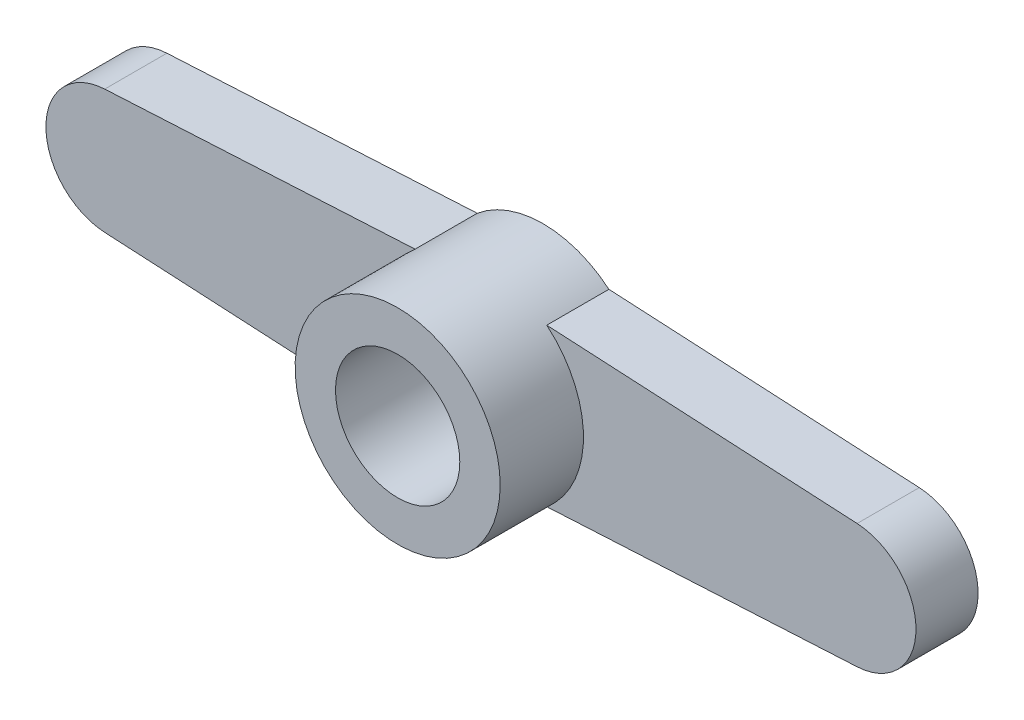
ISO-10303-21;
HEADER;
FILE_DESCRIPTION(('STEP AP214'),'2;1');
FILE_NAME('part.step','',(''),(''),'','','');
FILE_SCHEMA(('AUTOMOTIVE_DESIGN { 1 0 10303 214 1 1 1 1 }'));
ENDSEC;
DATA;
#1=APPLICATION_CONTEXT('core data for automotive mechanical design processes');
#2=APPLICATION_PROTOCOL_DEFINITION('international standard','automotive_design',2000,#1);
#3=PRODUCT_CONTEXT('',#1,'mechanical');
#4=PRODUCT('Part','Part','',(#3));
#5=PRODUCT_RELATED_PRODUCT_CATEGORY('part','',(#4));
#6=PRODUCT_DEFINITION_FORMATION('','',#4);
#7=PRODUCT_DEFINITION_CONTEXT('part definition',#1,'design');
#8=PRODUCT_DEFINITION('design','',#6,#7);
#9=PRODUCT_DEFINITION_SHAPE('','',#8);
#10=(LENGTH_UNIT() NAMED_UNIT(*) SI_UNIT(.MILLI.,.METRE.));
#11=(NAMED_UNIT(*) PLANE_ANGLE_UNIT() SI_UNIT($,.RADIAN.));
#12=(NAMED_UNIT(*) SI_UNIT($,.STERADIAN.) SOLID_ANGLE_UNIT());
#13=UNCERTAINTY_MEASURE_WITH_UNIT(LENGTH_MEASURE(1.E-05),#10,'distance_accuracy_value','');
#14=(GEOMETRIC_REPRESENTATION_CONTEXT(3) GLOBAL_UNCERTAINTY_ASSIGNED_CONTEXT((#13)) GLOBAL_UNIT_ASSIGNED_CONTEXT((#10,
#11,#12)) REPRESENTATION_CONTEXT('',''));
#15=CARTESIAN_POINT('',(0.,0.,0.));
#16=DIRECTION('',(0.,0.,1.));
#17=DIRECTION('',(1.,0.,0.));
#18=AXIS2_PLACEMENT_3D('',#15,#16,#17);
#19=CARTESIAN_POINT('',(0.,0.,2.));
#20=DIRECTION('',(0.,0.,-1.));
#21=DIRECTION('',(-1.,0.,0.));
#22=AXIS2_PLACEMENT_3D('',#19,#20,#21);
#23=CYLINDRICAL_SURFACE('',#22,2.);
#24=CARTESIAN_POINT('',(0.,0.,4.68));
#25=DIRECTION('',(0.,0.,1.));
#26=DIRECTION('',(1.,0.,0.));
#27=AXIS2_PLACEMENT_3D('',#24,#25,#26);
#28=CIRCLE('',#27,2.);
#29=CARTESIAN_POINT('',(2.,0.,4.68));
#30=VERTEX_POINT('',#29);
#31=EDGE_CURVE('E175',#30,#30,#28,.T.);
#32=ORIENTED_EDGE('',*,*,#31,.T.);
#33=EDGE_LOOP('',(#32));
#34=FACE_BOUND('',#33,.T.);
#35=CARTESIAN_POINT('',(0.,0.,1.));
#36=DIRECTION('',(0.,0.,-1.));
#37=DIRECTION('',(-1.,0.,0.));
#38=AXIS2_PLACEMENT_3D('',#35,#36,#37);
#39=CIRCLE('',#38,2.);
#40=CARTESIAN_POINT('',(-2.,0.,1.));
#41=VERTEX_POINT('',#40);
#42=EDGE_CURVE('E178',#41,#41,#39,.T.);
#43=ORIENTED_EDGE('',*,*,#42,.T.);
#44=EDGE_LOOP('',(#43));
#45=FACE_BOUND('',#44,.T.);
#46=ADVANCED_FACE('F41',(#34,#45),#23,.F.);
#47=CARTESIAN_POINT('',(0.,0.,2.));
#48=DIRECTION('',(0.,0.,1.));
#49=DIRECTION('',(1.,0.,0.));
#50=AXIS2_PLACEMENT_3D('',#47,#48,#49);
#51=PLANE('',#50);
#52=CARTESIAN_POINT('',(0.,0.,2.));
#53=DIRECTION('',(0.,0.,1.));
#54=DIRECTION('',(1.,0.,0.));
#55=AXIS2_PLACEMENT_3D('',#52,#53,#54);
#56=CIRCLE('',#55,3.3);
#57=CARTESIAN_POINT('',(-2.11874963126841,2.53,2.));
#58=VERTEX_POINT('',#57);
#59=CARTESIAN_POINT('',(-2.1187496312684,-2.53,2.));
#60=VERTEX_POINT('',#59);
#61=EDGE_CURVE('E12',#58,#60,#56,.T.);
#62=ORIENTED_EDGE('',*,*,#61,.F.);
#63=DIRECTION('',(0.998579966806686,0.0532733506770244,0.));
#64=VECTOR('',#63,1.);
#65=CARTESIAN_POINT('',(-0.140603300062335,2.6355323426223,2.));
#66=LINE('',#65,#64);
#67=CARTESIAN_POINT('',(-12.106546701354,1.99715993361337,2.));
#68=VERTEX_POINT('',#67);
#69=EDGE_CURVE('E135',#68,#58,#66,.T.);
#70=ORIENTED_EDGE('',*,*,#69,.F.);
#71=CARTESIAN_POINT('',(-12.,0.,2.));
#72=DIRECTION('',(0.,0.,1.));
#73=DIRECTION('',(1.,0.,0.));
#74=AXIS2_PLACEMENT_3D('',#71,#72,#73);
#75=CIRCLE('',#74,2.);
#76=CARTESIAN_POINT('',(-12.106546701354,-1.99715993361338,2.));
#77=VERTEX_POINT('',#76);
#78=EDGE_CURVE('E158',#77,#68,#75,.F.);
#79=ORIENTED_EDGE('',*,*,#78,.F.);
#80=DIRECTION('',(0.998579966806686,-0.0532733506770242,0.));
#81=VECTOR('',#80,1.);
#82=CARTESIAN_POINT('',(-0.140603300062335,-2.6355323426223,2.));
#83=LINE('',#82,#81);
#84=EDGE_CURVE('E180',#77,#60,#83,.T.);
#85=ORIENTED_EDGE('',*,*,#84,.T.);
#86=EDGE_LOOP('',(#62,#70,#79,#85));
#87=FACE_BOUND('',#86,.T.);
#88=ADVANCED_FACE('F197',(#87),#51,.T.);
#89=CARTESIAN_POINT('',(-12.,0.,2.));
#90=DIRECTION('',(0.,0.,-1.));
#91=DIRECTION('',(-1.,0.,0.));
#92=AXIS2_PLACEMENT_3D('',#89,#90,#91);
#93=CYLINDRICAL_SURFACE('',#92,2.);
#94=CARTESIAN_POINT('',(-12.,0.,0.));
#95=DIRECTION('',(0.,0.,1.));
#96=DIRECTION('',(1.,0.,0.));
#97=AXIS2_PLACEMENT_3D('',#94,#95,#96);
#98=CIRCLE('',#97,2.);
#99=CARTESIAN_POINT('',(-12.106546701354,-1.99715993361338,0.));
#100=VERTEX_POINT('',#99);
#101=CARTESIAN_POINT('',(-12.106546701354,1.99715993361337,0.));
#102=VERTEX_POINT('',#101);
#103=EDGE_CURVE('E140',#100,#102,#98,.F.);
#104=ORIENTED_EDGE('',*,*,#103,.F.);
#105=DIRECTION('',(0.,0.,-1.));
#106=VECTOR('',#105,1.);
#107=CARTESIAN_POINT('',(-12.106546701354,-1.99715993361338,2.));
#108=LINE('',#107,#106);
#109=EDGE_CURVE('E45',#77,#100,#108,.T.);
#110=ORIENTED_EDGE('',*,*,#109,.F.);
#111=ORIENTED_EDGE('',*,*,#78,.T.);
#112=DIRECTION('',(0.,0.,-1.));
#113=VECTOR('',#112,1.);
#114=CARTESIAN_POINT('',(-12.106546701354,1.99715993361337,2.));
#115=LINE('',#114,#113);
#116=EDGE_CURVE('E60',#68,#102,#115,.T.);
#117=ORIENTED_EDGE('',*,*,#116,.T.);
#118=EDGE_LOOP('',(#104,#110,#111,#117));
#119=FACE_BOUND('',#118,.T.);
#120=ADVANCED_FACE('F43',(#119),#93,.T.);
#121=CARTESIAN_POINT('',(-0.140603300062335,-2.6355323426223,2.));
#122=DIRECTION('',(0.0532733506770242,0.998579966806686,0.));
#123=DIRECTION('',(-0.998579966806686,0.0532733506770242,0.));
#124=AXIS2_PLACEMENT_3D('',#121,#122,#123);
#125=PLANE('',#124);
#126=DIRECTION('',(0.998579966806686,-0.0532733506770242,0.));
#127=VECTOR('',#126,1.);
#128=CARTESIAN_POINT('',(-0.140603300062335,-2.6355323426223,0.));
#129=LINE('',#128,#127);
#130=CARTESIAN_POINT('',(-2.1187496312684,-2.53,0.));
#131=VERTEX_POINT('',#130);
#132=EDGE_CURVE('E142',#100,#131,#129,.T.);
#133=ORIENTED_EDGE('',*,*,#132,.T.);
#134=DIRECTION('',(0.,0.,-1.));
#135=VECTOR('',#134,1.);
#136=CARTESIAN_POINT('',(-2.1187496312684,-2.53,2.));
#137=LINE('',#136,#135);
#138=EDGE_CURVE('E164',#60,#131,#137,.T.);
#139=ORIENTED_EDGE('',*,*,#138,.F.);
#140=ORIENTED_EDGE('',*,*,#84,.F.);
#141=ORIENTED_EDGE('',*,*,#109,.T.);
#142=EDGE_LOOP('',(#133,#139,#140,#141));
#143=FACE_BOUND('',#142,.T.);
#144=ADVANCED_FACE('F296',(#143),#125,.F.);
#145=CARTESIAN_POINT('',(0.140603300062335,-2.6355323426223,2.));
#146=DIRECTION('',(0.0532733506770242,-0.998579966806686,0.));
#147=DIRECTION('',(0.998579966806686,0.0532733506770242,0.));
#148=AXIS2_PLACEMENT_3D('',#145,#146,#147);
#149=PLANE('',#148);
#150=DIRECTION('',(-0.998579966806686,-0.0532733506770242,0.));
#151=VECTOR('',#150,1.);
#152=CARTESIAN_POINT('',(0.140603300062335,-2.6355323426223,0.));
#153=LINE('',#152,#151);
#154=CARTESIAN_POINT('',(12.106546701354,-1.99715993361338,0.));
#155=VERTEX_POINT('',#154);
#156=CARTESIAN_POINT('',(2.1187496312684,-2.53,0.));
#157=VERTEX_POINT('',#156);
#158=EDGE_CURVE('E148',#155,#157,#153,.T.);
#159=ORIENTED_EDGE('',*,*,#158,.F.);
#160=DIRECTION('',(0.,0.,-1.));
#161=VECTOR('',#160,1.);
#162=CARTESIAN_POINT('',(12.106546701354,-1.99715993361338,2.));
#163=LINE('',#162,#161);
#164=CARTESIAN_POINT('',(12.106546701354,-1.99715993361338,2.));
#165=VERTEX_POINT('',#164);
#166=EDGE_CURVE('E129',#165,#155,#163,.T.);
#167=ORIENTED_EDGE('',*,*,#166,.F.);
#168=DIRECTION('',(-0.998579966806686,-0.0532733506770242,0.));
#169=VECTOR('',#168,1.);
#170=CARTESIAN_POINT('',(0.140603300062335,-2.6355323426223,2.));
#171=LINE('',#170,#169);
#172=CARTESIAN_POINT('',(2.1187496312684,-2.53,2.));
#173=VERTEX_POINT('',#172);
#174=EDGE_CURVE('E119',#165,#173,#171,.T.);
#175=ORIENTED_EDGE('',*,*,#174,.T.);
#176=DIRECTION('',(0.,0.,-1.));
#177=VECTOR('',#176,1.);
#178=CARTESIAN_POINT('',(2.1187496312684,-2.53,2.));
#179=LINE('',#178,#177);
#180=EDGE_CURVE('E163',#173,#157,#179,.T.);
#181=ORIENTED_EDGE('',*,*,#180,.T.);
#182=EDGE_LOOP('',(#159,#167,#175,#181));
#183=FACE_BOUND('',#182,.T.);
#184=ADVANCED_FACE('F183',(#183),#149,.T.);
#185=CARTESIAN_POINT('',(12.,0.,2.));
#186=DIRECTION('',(0.,0.,-1.));
#187=DIRECTION('',(-1.,0.,0.));
#188=AXIS2_PLACEMENT_3D('',#185,#186,#187);
#189=CYLINDRICAL_SURFACE('',#188,2.);
#190=CARTESIAN_POINT('',(12.,0.,0.));
#191=DIRECTION('',(0.,0.,1.));
#192=DIRECTION('',(1.,0.,0.));
#193=AXIS2_PLACEMENT_3D('',#190,#191,#192);
#194=CIRCLE('',#193,2.);
#195=CARTESIAN_POINT('',(12.106546701354,1.99715993361337,0.));
#196=VERTEX_POINT('',#195);
#197=EDGE_CURVE('E126',#155,#196,#194,.T.);
#198=ORIENTED_EDGE('',*,*,#197,.T.);
#199=DIRECTION('',(0.,0.,-1.));
#200=VECTOR('',#199,1.);
#201=CARTESIAN_POINT('',(12.106546701354,1.99715993361337,2.));
#202=LINE('',#201,#200);
#203=CARTESIAN_POINT('',(12.106546701354,1.99715993361337,2.));
#204=VERTEX_POINT('',#203);
#205=EDGE_CURVE('E123',#204,#196,#202,.T.);
#206=ORIENTED_EDGE('',*,*,#205,.F.);
#207=CARTESIAN_POINT('',(12.,0.,2.));
#208=DIRECTION('',(0.,0.,1.));
#209=DIRECTION('',(1.,0.,0.));
#210=AXIS2_PLACEMENT_3D('',#207,#208,#209);
#211=CIRCLE('',#210,2.);
#212=EDGE_CURVE('E112',#165,#204,#211,.T.);
#213=ORIENTED_EDGE('',*,*,#212,.F.);
#214=ORIENTED_EDGE('',*,*,#166,.T.);
#215=EDGE_LOOP('',(#198,#206,#213,#214));
#216=FACE_BOUND('',#215,.T.);
#217=ADVANCED_FACE('F124',(#216),#189,.T.);
#218=CARTESIAN_POINT('',(0.140603300062335,2.6355323426223,2.));
#219=DIRECTION('',(-0.0532733506770244,-0.998579966806686,0.));
#220=DIRECTION('',(0.998579966806686,-0.0532733506770244,0.));
#221=AXIS2_PLACEMENT_3D('',#218,#219,#220);
#222=PLANE('',#221);
#223=DIRECTION('',(-0.998579966806686,0.0532733506770244,0.));
#224=VECTOR('',#223,1.);
#225=CARTESIAN_POINT('',(0.140603300062335,2.6355323426223,0.));
#226=LINE('',#225,#224);
#227=CARTESIAN_POINT('',(2.1187496312684,2.53,0.));
#228=VERTEX_POINT('',#227);
#229=EDGE_CURVE('E153',#196,#228,#226,.T.);
#230=ORIENTED_EDGE('',*,*,#229,.T.);
#231=DIRECTION('',(0.,0.,-1.));
#232=VECTOR('',#231,1.);
#233=CARTESIAN_POINT('',(2.1187496312684,2.53,2.));
#234=LINE('',#233,#232);
#235=CARTESIAN_POINT('',(2.1187496312684,2.53,2.));
#236=VERTEX_POINT('',#235);
#237=EDGE_CURVE('E130',#236,#228,#234,.T.);
#238=ORIENTED_EDGE('',*,*,#237,.F.);
#239=DIRECTION('',(-0.998579966806686,0.0532733506770244,0.));
#240=VECTOR('',#239,1.);
#241=CARTESIAN_POINT('',(0.140603300062335,2.6355323426223,2.));
#242=LINE('',#241,#240);
#243=EDGE_CURVE('E116',#204,#236,#242,.T.);
#244=ORIENTED_EDGE('',*,*,#243,.F.);
#245=ORIENTED_EDGE('',*,*,#205,.T.);
#246=EDGE_LOOP('',(#230,#238,#244,#245));
#247=FACE_BOUND('',#246,.T.);
#248=ADVANCED_FACE('F133',(#247),#222,.F.);
#249=CARTESIAN_POINT('',(0.,0.,2.));
#250=DIRECTION('',(0.,0.,-1.));
#251=DIRECTION('',(-1.,0.,0.));
#252=AXIS2_PLACEMENT_3D('',#249,#250,#251);
#253=CYLINDRICAL_SURFACE('',#252,3.3);
#254=CARTESIAN_POINT('',(0.,0.,0.));
#255=DIRECTION('',(0.,0.,1.));
#256=DIRECTION('',(1.,0.,0.));
#257=AXIS2_PLACEMENT_3D('',#254,#255,#256);
#258=CIRCLE('',#257,3.3);
#259=CARTESIAN_POINT('',(-2.11874963126841,2.53,0.));
#260=VERTEX_POINT('',#259);
#261=EDGE_CURVE('E149',#228,#260,#258,.T.);
#262=ORIENTED_EDGE('',*,*,#261,.T.);
#263=DIRECTION('',(0.,0.,-1.));
#264=VECTOR('',#263,1.);
#265=CARTESIAN_POINT('',(-2.11874963126841,2.53,2.));
#266=LINE('',#265,#264);
#267=EDGE_CURVE('E88',#58,#260,#266,.T.);
#268=ORIENTED_EDGE('',*,*,#267,.F.);
#269=ORIENTED_EDGE('',*,*,#61,.T.);
#270=ORIENTED_EDGE('',*,*,#138,.T.);
#271=EDGE_CURVE('E145',#131,#157,#258,.T.);
#272=ORIENTED_EDGE('',*,*,#271,.T.);
#273=ORIENTED_EDGE('',*,*,#180,.F.);
#274=EDGE_CURVE('E51',#173,#236,#56,.T.);
#275=ORIENTED_EDGE('',*,*,#274,.T.);
#276=ORIENTED_EDGE('',*,*,#237,.T.);
#277=EDGE_LOOP('',(#262,#268,#269,#270,#272,#273,#275,#276));
#278=FACE_BOUND('',#277,.T.);
#279=CARTESIAN_POINT('',(0.,0.,4.68));
#280=DIRECTION('',(0.,0.,1.));
#281=DIRECTION('',(1.,0.,0.));
#282=AXIS2_PLACEMENT_3D('',#279,#280,#281);
#283=CIRCLE('',#282,3.3);
#284=CARTESIAN_POINT('',(3.3,0.,4.68));
#285=VERTEX_POINT('',#284);
#286=EDGE_CURVE('E143',#285,#285,#283,.T.);
#287=ORIENTED_EDGE('',*,*,#286,.F.);
#288=EDGE_LOOP('',(#287));
#289=FACE_BOUND('',#288,.T.);
#290=ADVANCED_FACE('F187',(#278,#289),#253,.T.);
#291=CARTESIAN_POINT('',(-0.140603300062335,2.6355323426223,2.));
#292=DIRECTION('',(-0.0532733506770244,0.998579966806686,0.));
#293=DIRECTION('',(-0.998579966806686,-0.0532733506770244,0.));
#294=AXIS2_PLACEMENT_3D('',#291,#292,#293);
#295=PLANE('',#294);
#296=DIRECTION('',(0.998579966806686,0.0532733506770244,0.));
#297=VECTOR('',#296,1.);
#298=CARTESIAN_POINT('',(-0.140603300062335,2.6355323426223,0.));
#299=LINE('',#298,#297);
#300=EDGE_CURVE('E155',#102,#260,#299,.T.);
#301=ORIENTED_EDGE('',*,*,#300,.F.);
#302=ORIENTED_EDGE('',*,*,#116,.F.);
#303=ORIENTED_EDGE('',*,*,#69,.T.);
#304=ORIENTED_EDGE('',*,*,#267,.T.);
#305=EDGE_LOOP('',(#301,#302,#303,#304));
#306=FACE_BOUND('',#305,.T.);
#307=ADVANCED_FACE('F189',(#306),#295,.T.);
#308=ORIENTED_EDGE('',*,*,#274,.F.);
#309=ORIENTED_EDGE('',*,*,#174,.F.);
#310=ORIENTED_EDGE('',*,*,#212,.T.);
#311=ORIENTED_EDGE('',*,*,#243,.T.);
#312=EDGE_LOOP('',(#308,#309,#310,#311));
#313=FACE_BOUND('',#312,.T.);
#314=ADVANCED_FACE('F114',(#313),#51,.T.);
#315=CARTESIAN_POINT('',(0.,0.,0.));
#316=DIRECTION('',(0.,0.,1.));
#317=DIRECTION('',(1.,0.,0.));
#318=AXIS2_PLACEMENT_3D('',#315,#316,#317);
#319=PLANE('',#318);
#320=CARTESIAN_POINT('',(0.,0.,0.));
#321=DIRECTION('',(0.,0.,-1.));
#322=DIRECTION('',(-1.,0.,0.));
#323=AXIS2_PLACEMENT_3D('',#320,#321,#322);
#324=CIRCLE('',#323,2.35);
#325=CARTESIAN_POINT('',(-2.35,0.,0.));
#326=VERTEX_POINT('',#325);
#327=EDGE_CURVE('E230',#326,#326,#324,.T.);
#328=ORIENTED_EDGE('',*,*,#327,.F.);
#329=EDGE_LOOP('',(#328));
#330=FACE_BOUND('',#329,.T.);
#331=ORIENTED_EDGE('',*,*,#103,.T.);
#332=ORIENTED_EDGE('',*,*,#300,.T.);
#333=ORIENTED_EDGE('',*,*,#261,.F.);
#334=ORIENTED_EDGE('',*,*,#229,.F.);
#335=ORIENTED_EDGE('',*,*,#197,.F.);
#336=ORIENTED_EDGE('',*,*,#158,.T.);
#337=ORIENTED_EDGE('',*,*,#271,.F.);
#338=ORIENTED_EDGE('',*,*,#132,.F.);
#339=EDGE_LOOP('',(#331,#332,#333,#334,#335,#336,#337,#338));
#340=FACE_BOUND('',#339,.T.);
#341=ADVANCED_FACE('F185',(#330,#340),#319,.F.);
#342=CARTESIAN_POINT('',(0.,0.,4.68));
#343=DIRECTION('',(0.,0.,1.));
#344=DIRECTION('',(1.,0.,0.));
#345=AXIS2_PLACEMENT_3D('',#342,#343,#344);
#346=PLANE('',#345);
#347=ORIENTED_EDGE('',*,*,#31,.F.);
#348=EDGE_LOOP('',(#347));
#349=FACE_BOUND('',#348,.T.);
#350=ORIENTED_EDGE('',*,*,#286,.T.);
#351=EDGE_LOOP('',(#350));
#352=FACE_BOUND('',#351,.T.);
#353=ADVANCED_FACE('F209',(#349,#352),#346,.T.);
#354=CARTESIAN_POINT('',(0.,0.,1.));
#355=DIRECTION('',(0.,0.,-1.));
#356=DIRECTION('',(-1.,0.,0.));
#357=AXIS2_PLACEMENT_3D('',#354,#355,#356);
#358=PLANE('',#357);
#359=ORIENTED_EDGE('',*,*,#42,.F.);
#360=EDGE_LOOP('',(#359));
#361=FACE_BOUND('',#360,.T.);
#362=CARTESIAN_POINT('',(0.,0.,1.));
#363=DIRECTION('',(0.,0.,-1.));
#364=DIRECTION('',(-1.,0.,0.));
#365=AXIS2_PLACEMENT_3D('',#362,#363,#364);
#366=CIRCLE('',#365,2.35);
#367=CARTESIAN_POINT('',(-2.35,0.,1.));
#368=VERTEX_POINT('',#367);
#369=EDGE_CURVE('E229',#368,#368,#366,.T.);
#370=ORIENTED_EDGE('',*,*,#369,.T.);
#371=EDGE_LOOP('',(#370));
#372=FACE_BOUND('',#371,.T.);
#373=ADVANCED_FACE('F214',(#361,#372),#358,.T.);
#374=CARTESIAN_POINT('',(0.,0.,1.));
#375=DIRECTION('',(0.,0.,-1.));
#376=DIRECTION('',(-1.,0.,0.));
#377=AXIS2_PLACEMENT_3D('',#374,#375,#376);
#378=CYLINDRICAL_SURFACE('',#377,2.35);
#379=ORIENTED_EDGE('',*,*,#369,.F.);
#380=EDGE_LOOP('',(#379));
#381=FACE_BOUND('',#380,.T.);
#382=ORIENTED_EDGE('',*,*,#327,.T.);
#383=EDGE_LOOP('',(#382));
#384=FACE_BOUND('',#383,.T.);
#385=ADVANCED_FACE('F216',(#381,#384),#378,.F.);
#386=CLOSED_SHELL('',(#46,#88,#120,#144,#184,#217,#248,#290,#307,#314,#341,#353,#373,#385));
#387=MANIFOLD_SOLID_BREP('B2',#386);
#388=ADVANCED_BREP_SHAPE_REPRESENTATION('',(#18,#387),#14);
#389=SHAPE_DEFINITION_REPRESENTATION(#9,#388);
ENDSEC;
END-ISO-10303-21;
